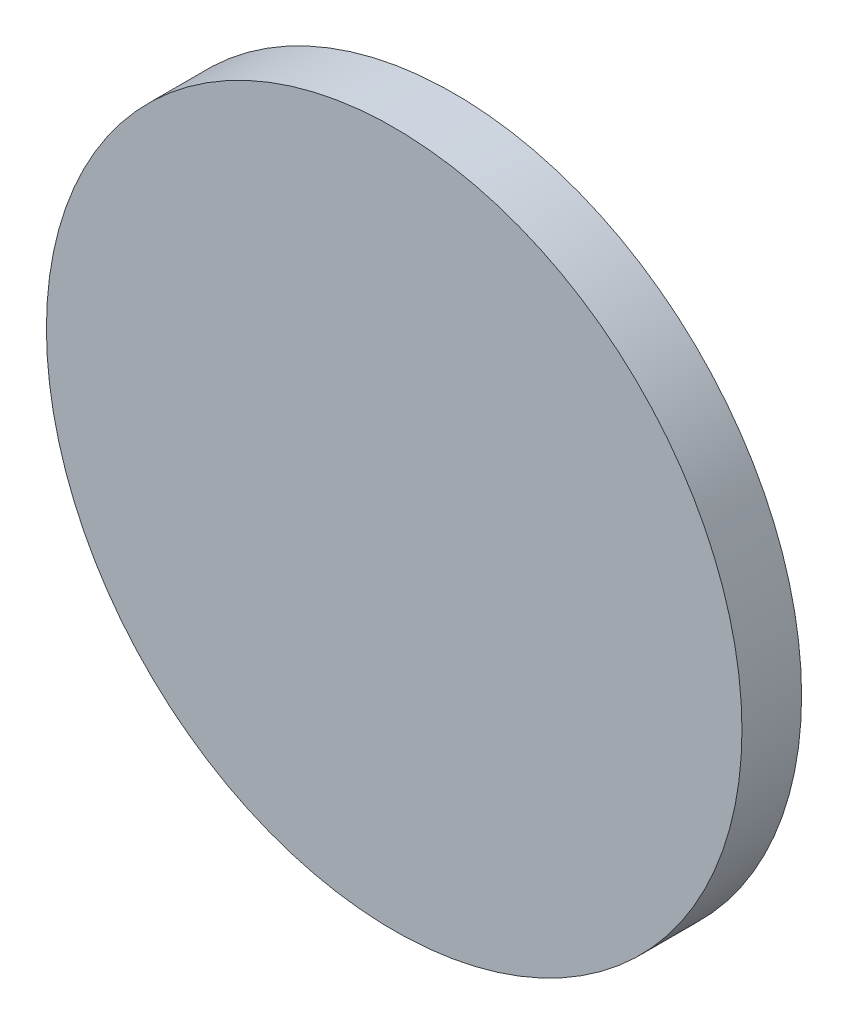
ISO-10303-21;
HEADER;
FILE_DESCRIPTION(('STEP AP214'),'2;1');
FILE_NAME('part.step','',(''),(''),'','','');
FILE_SCHEMA(('AUTOMOTIVE_DESIGN { 1 0 10303 214 1 1 1 1 }'));
ENDSEC;
DATA;
#1=APPLICATION_CONTEXT('core data for automotive mechanical design processes');
#2=APPLICATION_PROTOCOL_DEFINITION('international standard','automotive_design',2000,#1);
#3=PRODUCT_CONTEXT('',#1,'mechanical');
#4=PRODUCT('Part','Part','',(#3));
#5=PRODUCT_RELATED_PRODUCT_CATEGORY('part','',(#4));
#6=PRODUCT_DEFINITION_FORMATION('','',#4);
#7=PRODUCT_DEFINITION_CONTEXT('part definition',#1,'design');
#8=PRODUCT_DEFINITION('design','',#6,#7);
#9=PRODUCT_DEFINITION_SHAPE('','',#8);
#10=(LENGTH_UNIT() NAMED_UNIT(*) SI_UNIT(.MILLI.,.METRE.));
#11=(NAMED_UNIT(*) PLANE_ANGLE_UNIT() SI_UNIT($,.RADIAN.));
#12=(NAMED_UNIT(*) SI_UNIT($,.STERADIAN.) SOLID_ANGLE_UNIT());
#13=UNCERTAINTY_MEASURE_WITH_UNIT(LENGTH_MEASURE(1.E-05),#10,'distance_accuracy_value','');
#14=(GEOMETRIC_REPRESENTATION_CONTEXT(3) GLOBAL_UNCERTAINTY_ASSIGNED_CONTEXT((#13)) GLOBAL_UNIT_ASSIGNED_CONTEXT((#10,
#11,#12)) REPRESENTATION_CONTEXT('',''));
#15=CARTESIAN_POINT('',(0.,0.,0.));
#16=DIRECTION('',(0.,0.,1.));
#17=DIRECTION('',(1.,0.,0.));
#18=AXIS2_PLACEMENT_3D('',#15,#16,#17);
#19=CARTESIAN_POINT('',(9.73836,1.577340014875,0.76487));
#20=DIRECTION('',(0.,0.,-1.));
#21=DIRECTION('',(-1.,0.,0.));
#22=AXIS2_PLACEMENT_3D('',#19,#20,#21);
#23=PLANE('',#22);
#24=CARTESIAN_POINT('',(9.73836,1.577340014875,0.76487));
#25=DIRECTION('',(0.,0.,1.));
#26=DIRECTION('',(1.,0.,0.));
#27=AXIS2_PLACEMENT_3D('',#24,#25,#26);
#28=CIRCLE('',#27,0.200024667);
#29=CARTESIAN_POINT('',(9.938384667,1.577340014875,0.76487));
#30=VERTEX_POINT('',#29);
#31=EDGE_CURVE('E18',#30,#30,#28,.T.);
#32=ORIENTED_EDGE('',*,*,#31,.F.);
#33=EDGE_LOOP('',(#32));
#34=FACE_BOUND('',#33,.T.);
#35=ADVANCED_FACE('F15',(#34),#23,.T.);
#36=CARTESIAN_POINT('',(9.73836,1.577340014875,0.76487));
#37=DIRECTION('',(0.,0.,1.));
#38=DIRECTION('',(1.,0.,0.));
#39=AXIS2_PLACEMENT_3D('',#36,#37,#38);
#40=CYLINDRICAL_SURFACE('',#39,0.200024667);
#41=CARTESIAN_POINT('',(9.73836,1.577340014875,0.79916));
#42=DIRECTION('',(0.,0.,1.));
#43=DIRECTION('',(1.,0.,0.));
#44=AXIS2_PLACEMENT_3D('',#41,#42,#43);
#45=CIRCLE('',#44,0.200024667);
#46=CARTESIAN_POINT('',(9.938384667,1.577340014875,0.79916));
#47=VERTEX_POINT('',#46);
#48=EDGE_CURVE('E10',#47,#47,#45,.T.);
#49=ORIENTED_EDGE('',*,*,#48,.F.);
#50=EDGE_LOOP('',(#49));
#51=FACE_BOUND('',#50,.T.);
#52=ORIENTED_EDGE('',*,*,#31,.T.);
#53=EDGE_LOOP('',(#52));
#54=FACE_BOUND('',#53,.T.);
#55=ADVANCED_FACE('F27',(#51,#54),#40,.T.);
#56=CARTESIAN_POINT('',(9.73836,1.577340014875,0.79916));
#57=DIRECTION('',(0.,0.,1.));
#58=DIRECTION('',(1.,0.,0.));
#59=AXIS2_PLACEMENT_3D('',#56,#57,#58);
#60=PLANE('',#59);
#61=ORIENTED_EDGE('',*,*,#48,.T.);
#62=EDGE_LOOP('',(#61));
#63=FACE_BOUND('',#62,.T.);
#64=ADVANCED_FACE('F34',(#63),#60,.T.);
#65=CLOSED_SHELL('',(#35,#55,#64));
#66=MANIFOLD_SOLID_BREP('B1',#65);
#67=ADVANCED_BREP_SHAPE_REPRESENTATION('',(#18,#66),#14);
#68=SHAPE_DEFINITION_REPRESENTATION(#9,#67);
ENDSEC;
END-ISO-10303-21;
